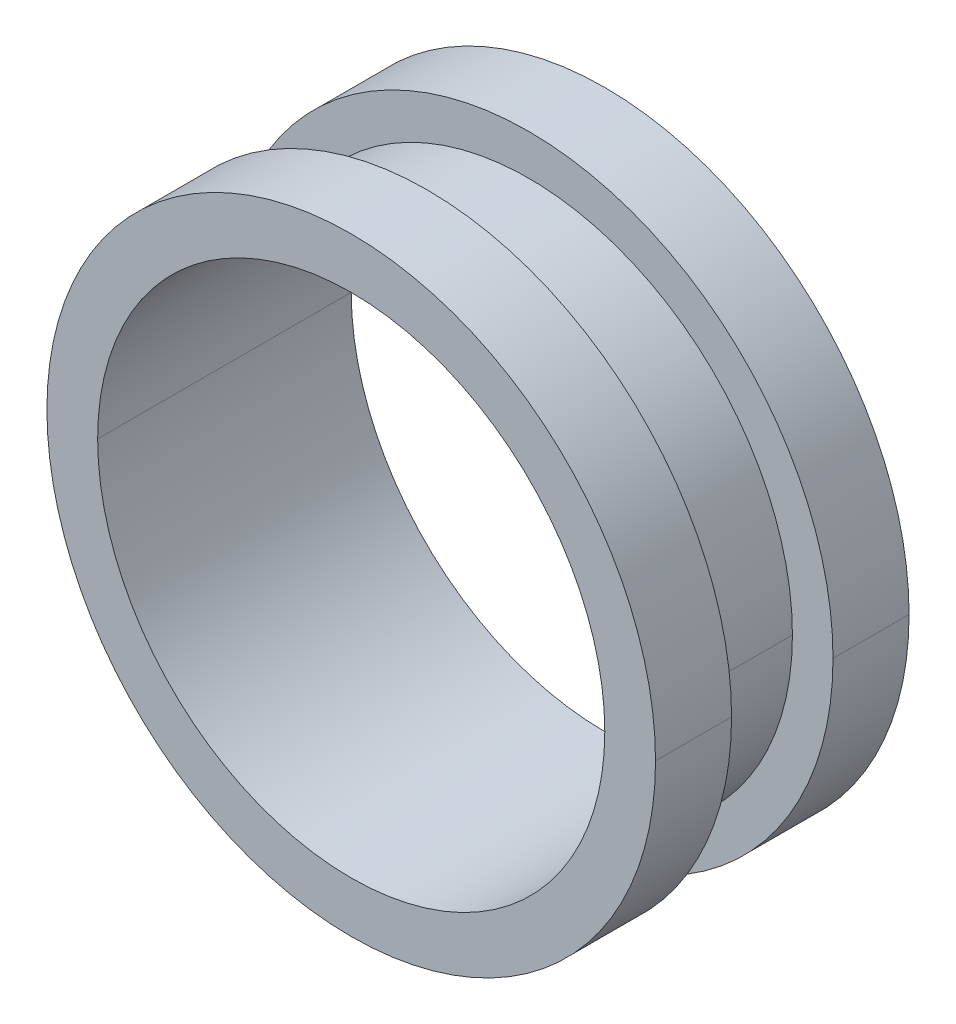
ISO-10303-21;
HEADER;
FILE_DESCRIPTION(('STEP AP214'),'2;1');
FILE_NAME('part.step','',(''),(''),'','','');
FILE_SCHEMA(('AUTOMOTIVE_DESIGN { 1 0 10303 214 1 1 1 1 }'));
ENDSEC;
DATA;
#1=APPLICATION_CONTEXT('core data for automotive mechanical design processes');
#2=APPLICATION_PROTOCOL_DEFINITION('international standard','automotive_design',2000,#1);
#3=PRODUCT_CONTEXT('',#1,'mechanical');
#4=PRODUCT('Part','Part','',(#3));
#5=PRODUCT_RELATED_PRODUCT_CATEGORY('part','',(#4));
#6=PRODUCT_DEFINITION_FORMATION('','',#4);
#7=PRODUCT_DEFINITION_CONTEXT('part definition',#1,'design');
#8=PRODUCT_DEFINITION('design','',#6,#7);
#9=PRODUCT_DEFINITION_SHAPE('','',#8);
#10=(LENGTH_UNIT() NAMED_UNIT(*) SI_UNIT(.MILLI.,.METRE.));
#11=(NAMED_UNIT(*) PLANE_ANGLE_UNIT() SI_UNIT($,.RADIAN.));
#12=(NAMED_UNIT(*) SI_UNIT($,.STERADIAN.) SOLID_ANGLE_UNIT());
#13=UNCERTAINTY_MEASURE_WITH_UNIT(LENGTH_MEASURE(1.E-05),#10,'distance_accuracy_value','');
#14=(GEOMETRIC_REPRESENTATION_CONTEXT(3) GLOBAL_UNCERTAINTY_ASSIGNED_CONTEXT((#13)) GLOBAL_UNIT_ASSIGNED_CONTEXT((#10,
#11,#12)) REPRESENTATION_CONTEXT('',''));
#15=CARTESIAN_POINT('',(0.,0.,0.));
#16=DIRECTION('',(0.,0.,1.));
#17=DIRECTION('',(1.,0.,0.));
#18=AXIS2_PLACEMENT_3D('',#15,#16,#17);
#19=CARTESIAN_POINT('',(0.,0.,-0.5));
#20=DIRECTION('',(0.,0.,1.));
#21=DIRECTION('',(1.,0.,0.));
#22=AXIS2_PLACEMENT_3D('',#19,#20,#21);
#23=CYLINDRICAL_SURFACE('',#22,2.6);
#24=DIRECTION('',(0.,0.,1.));
#25=VECTOR('',#24,1.);
#26=CARTESIAN_POINT('',(-2.6,0.,-0.5));
#27=LINE('',#26,#25);
#28=CARTESIAN_POINT('',(-2.6,0.,-0.5));
#29=VERTEX_POINT('',#28);
#30=CARTESIAN_POINT('',(-2.6,0.,0.5));
#31=VERTEX_POINT('',#30);
#32=EDGE_CURVE('E147',#29,#31,#27,.T.);
#33=ORIENTED_EDGE('',*,*,#32,.F.);
#34=CARTESIAN_POINT('',(0.,0.,-0.5));
#35=DIRECTION('',(0.,0.,1.));
#36=DIRECTION('',(1.,0.,0.));
#37=AXIS2_PLACEMENT_3D('',#34,#35,#36);
#38=CIRCLE('',#37,2.6);
#39=CARTESIAN_POINT('',(2.6,0.,-0.5));
#40=VERTEX_POINT('',#39);
#41=EDGE_CURVE('E27',#29,#40,#38,.T.);
#42=ORIENTED_EDGE('',*,*,#41,.T.);
#43=DIRECTION('',(0.,0.,1.));
#44=VECTOR('',#43,1.);
#45=CARTESIAN_POINT('',(2.6,0.,-0.5));
#46=LINE('',#45,#44);
#47=CARTESIAN_POINT('',(2.6,0.,0.5));
#48=VERTEX_POINT('',#47);
#49=EDGE_CURVE('E135',#40,#48,#46,.T.);
#50=ORIENTED_EDGE('',*,*,#49,.T.);
#51=CARTESIAN_POINT('',(0.,0.,0.5));
#52=DIRECTION('',(0.,0.,1.));
#53=DIRECTION('',(1.,0.,0.));
#54=AXIS2_PLACEMENT_3D('',#51,#52,#53);
#55=CIRCLE('',#54,2.6);
#56=EDGE_CURVE('E11',#31,#48,#55,.T.);
#57=ORIENTED_EDGE('',*,*,#56,.F.);
#58=EDGE_LOOP('',(#33,#42,#50,#57));
#59=FACE_BOUND('',#58,.T.);
#60=ADVANCED_FACE('F17',(#59),#23,.T.);
#61=CARTESIAN_POINT('',(0.,0.,0.5));
#62=DIRECTION('',(0.,0.,1.));
#63=DIRECTION('',(1.,0.,0.));
#64=AXIS2_PLACEMENT_3D('',#61,#62,#63);
#65=PLANE('',#64);
#66=CARTESIAN_POINT('',(0.,0.,0.5));
#67=DIRECTION('',(0.,0.,1.));
#68=DIRECTION('',(1.,0.,0.));
#69=AXIS2_PLACEMENT_3D('',#66,#67,#68);
#70=CIRCLE('',#69,2.6);
#71=EDGE_CURVE('E144',#48,#31,#70,.T.);
#72=ORIENTED_EDGE('',*,*,#71,.T.);
#73=ORIENTED_EDGE('',*,*,#56,.T.);
#74=EDGE_LOOP('',(#72,#73));
#75=FACE_BOUND('',#74,.T.);
#76=CARTESIAN_POINT('',(0.,0.,0.5));
#77=DIRECTION('',(0.,0.,1.));
#78=DIRECTION('',(1.,0.,0.));
#79=AXIS2_PLACEMENT_3D('',#76,#77,#78);
#80=CIRCLE('',#79,3.);
#81=CARTESIAN_POINT('',(-3.,0.,0.5));
#82=VERTEX_POINT('',#81);
#83=CARTESIAN_POINT('',(3.,0.,0.5));
#84=VERTEX_POINT('',#83);
#85=EDGE_CURVE('E118',#82,#84,#80,.T.);
#86=ORIENTED_EDGE('',*,*,#85,.F.);
#87=CARTESIAN_POINT('',(0.,0.,0.5));
#88=DIRECTION('',(0.,0.,1.));
#89=DIRECTION('',(1.,0.,0.));
#90=AXIS2_PLACEMENT_3D('',#87,#88,#89);
#91=CIRCLE('',#90,3.);
#92=EDGE_CURVE('E142',#84,#82,#91,.T.);
#93=ORIENTED_EDGE('',*,*,#92,.F.);
#94=EDGE_LOOP('',(#86,#93));
#95=FACE_BOUND('',#94,.T.);
#96=ADVANCED_FACE('F204',(#75,#95),#65,.F.);
#97=CARTESIAN_POINT('',(0.,0.,-0.5));
#98=DIRECTION('',(0.,0.,1.));
#99=DIRECTION('',(1.,0.,0.));
#100=AXIS2_PLACEMENT_3D('',#97,#98,#99);
#101=PLANE('',#100);
#102=CARTESIAN_POINT('',(0.,0.,-0.5));
#103=DIRECTION('',(0.,0.,1.));
#104=DIRECTION('',(1.,0.,0.));
#105=AXIS2_PLACEMENT_3D('',#102,#103,#104);
#106=CIRCLE('',#105,2.6);
#107=EDGE_CURVE('E157',#40,#29,#106,.T.);
#108=ORIENTED_EDGE('',*,*,#107,.F.);
#109=ORIENTED_EDGE('',*,*,#41,.F.);
#110=EDGE_LOOP('',(#108,#109));
#111=FACE_BOUND('',#110,.T.);
#112=CARTESIAN_POINT('',(0.,0.,-0.5));
#113=DIRECTION('',(0.,0.,1.));
#114=DIRECTION('',(1.,0.,0.));
#115=AXIS2_PLACEMENT_3D('',#112,#113,#114);
#116=CIRCLE('',#115,3.);
#117=CARTESIAN_POINT('',(-3.,0.,-0.5));
#118=VERTEX_POINT('',#117);
#119=CARTESIAN_POINT('',(3.,0.,-0.5));
#120=VERTEX_POINT('',#119);
#121=EDGE_CURVE('E152',#118,#120,#116,.T.);
#122=ORIENTED_EDGE('',*,*,#121,.T.);
#123=CARTESIAN_POINT('',(0.,0.,-0.5));
#124=DIRECTION('',(0.,0.,1.));
#125=DIRECTION('',(1.,0.,0.));
#126=AXIS2_PLACEMENT_3D('',#123,#124,#125);
#127=CIRCLE('',#126,3.);
#128=EDGE_CURVE('E172',#120,#118,#127,.T.);
#129=ORIENTED_EDGE('',*,*,#128,.T.);
#130=EDGE_LOOP('',(#122,#129));
#131=FACE_BOUND('',#130,.T.);
#132=ADVANCED_FACE('F296',(#111,#131),#101,.T.);
#133=CARTESIAN_POINT('',(0.,0.,1.25));
#134=DIRECTION('',(0.,0.,-1.));
#135=DIRECTION('',(-1.,0.,0.));
#136=AXIS2_PLACEMENT_3D('',#133,#134,#135);
#137=CYLINDRICAL_SURFACE('',#136,2.5);
#138=DIRECTION('',(0.,0.,-1.));
#139=VECTOR('',#138,1.);
#140=CARTESIAN_POINT('',(2.5,0.,1.25));
#141=LINE('',#140,#139);
#142=CARTESIAN_POINT('',(2.5,0.,1.25));
#143=VERTEX_POINT('',#142);
#144=CARTESIAN_POINT('',(2.5,0.,-1.25));
#145=VERTEX_POINT('',#144);
#146=EDGE_CURVE('E111',#143,#145,#141,.T.);
#147=ORIENTED_EDGE('',*,*,#146,.F.);
#148=CARTESIAN_POINT('',(0.,0.,1.25));
#149=DIRECTION('',(0.,0.,1.));
#150=DIRECTION('',(1.,0.,0.));
#151=AXIS2_PLACEMENT_3D('',#148,#149,#150);
#152=CIRCLE('',#151,2.5);
#153=CARTESIAN_POINT('',(-2.5,0.,1.25));
#154=VERTEX_POINT('',#153);
#155=EDGE_CURVE('E119',#143,#154,#152,.T.);
#156=ORIENTED_EDGE('',*,*,#155,.T.);
#157=DIRECTION('',(0.,0.,-1.));
#158=VECTOR('',#157,1.);
#159=CARTESIAN_POINT('',(-2.5,0.,1.25));
#160=LINE('',#159,#158);
#161=CARTESIAN_POINT('',(-2.5,0.,-1.25));
#162=VERTEX_POINT('',#161);
#163=EDGE_CURVE('E114',#154,#162,#160,.T.);
#164=ORIENTED_EDGE('',*,*,#163,.T.);
#165=CARTESIAN_POINT('',(0.,0.,-1.25));
#166=DIRECTION('',(0.,0.,1.));
#167=DIRECTION('',(1.,0.,0.));
#168=AXIS2_PLACEMENT_3D('',#165,#166,#167);
#169=CIRCLE('',#168,2.5);
#170=EDGE_CURVE('E107',#145,#162,#169,.T.);
#171=ORIENTED_EDGE('',*,*,#170,.F.);
#172=EDGE_LOOP('',(#147,#156,#164,#171));
#173=FACE_BOUND('',#172,.T.);
#174=ADVANCED_FACE('F109',(#173),#137,.F.);
#175=CARTESIAN_POINT('',(0.,0.,1.25));
#176=DIRECTION('',(0.,0.,-1.));
#177=DIRECTION('',(-1.,0.,0.));
#178=AXIS2_PLACEMENT_3D('',#175,#176,#177);
#179=CYLINDRICAL_SURFACE('',#178,3.);
#180=DIRECTION('',(0.,0.,-1.));
#181=VECTOR('',#180,1.);
#182=CARTESIAN_POINT('',(3.,0.,1.25));
#183=LINE('',#182,#181);
#184=CARTESIAN_POINT('',(3.,0.,1.25));
#185=VERTEX_POINT('',#184);
#186=EDGE_CURVE('E138',#185,#84,#183,.T.);
#187=ORIENTED_EDGE('',*,*,#186,.F.);
#188=CARTESIAN_POINT('',(0.,0.,1.25));
#189=DIRECTION('',(0.,0.,1.));
#190=DIRECTION('',(1.,0.,0.));
#191=AXIS2_PLACEMENT_3D('',#188,#189,#190);
#192=CIRCLE('',#191,3.);
#193=CARTESIAN_POINT('',(-3.,0.,1.25));
#194=VERTEX_POINT('',#193);
#195=EDGE_CURVE('E21',#194,#185,#192,.T.);
#196=ORIENTED_EDGE('',*,*,#195,.F.);
#197=DIRECTION('',(0.,0.,-1.));
#198=VECTOR('',#197,1.);
#199=CARTESIAN_POINT('',(-3.,0.,1.25));
#200=LINE('',#199,#198);
#201=EDGE_CURVE('E176',#194,#82,#200,.T.);
#202=ORIENTED_EDGE('',*,*,#201,.T.);
#203=ORIENTED_EDGE('',*,*,#85,.T.);
#204=EDGE_LOOP('',(#187,#196,#202,#203));
#205=FACE_BOUND('',#204,.T.);
#206=ADVANCED_FACE('F206',(#205),#179,.T.);
#207=CARTESIAN_POINT('',(0.,0.,-1.25));
#208=DIRECTION('',(0.,0.,1.));
#209=DIRECTION('',(1.,0.,0.));
#210=AXIS2_PLACEMENT_3D('',#207,#208,#209);
#211=PLANE('',#210);
#212=CARTESIAN_POINT('',(0.,0.,-1.25));
#213=DIRECTION('',(0.,0.,1.));
#214=DIRECTION('',(1.,0.,0.));
#215=AXIS2_PLACEMENT_3D('',#212,#213,#214);
#216=CIRCLE('',#215,2.5);
#217=EDGE_CURVE('E121',#162,#145,#216,.T.);
#218=ORIENTED_EDGE('',*,*,#217,.T.);
#219=ORIENTED_EDGE('',*,*,#170,.T.);
#220=EDGE_LOOP('',(#218,#219));
#221=FACE_BOUND('',#220,.T.);
#222=CARTESIAN_POINT('',(0.,0.,-1.25));
#223=DIRECTION('',(0.,0.,1.));
#224=DIRECTION('',(1.,0.,0.));
#225=AXIS2_PLACEMENT_3D('',#222,#223,#224);
#226=CIRCLE('',#225,3.);
#227=CARTESIAN_POINT('',(-3.,0.,-1.25));
#228=VERTEX_POINT('',#227);
#229=CARTESIAN_POINT('',(3.,0.,-1.25));
#230=VERTEX_POINT('',#229);
#231=EDGE_CURVE('E40',#228,#230,#226,.T.);
#232=ORIENTED_EDGE('',*,*,#231,.F.);
#233=CARTESIAN_POINT('',(0.,0.,-1.25));
#234=DIRECTION('',(0.,0.,1.));
#235=DIRECTION('',(1.,0.,0.));
#236=AXIS2_PLACEMENT_3D('',#233,#234,#235);
#237=CIRCLE('',#236,3.);
#238=EDGE_CURVE('E153',#230,#228,#237,.T.);
#239=ORIENTED_EDGE('',*,*,#238,.F.);
#240=EDGE_LOOP('',(#232,#239));
#241=FACE_BOUND('',#240,.T.);
#242=ADVANCED_FACE('F122',(#221,#241),#211,.F.);
#243=CARTESIAN_POINT('',(0.,0.,1.25));
#244=DIRECTION('',(0.,0.,1.));
#245=DIRECTION('',(1.,0.,0.));
#246=AXIS2_PLACEMENT_3D('',#243,#244,#245);
#247=PLANE('',#246);
#248=CARTESIAN_POINT('',(0.,0.,1.25));
#249=DIRECTION('',(0.,0.,1.));
#250=DIRECTION('',(1.,0.,0.));
#251=AXIS2_PLACEMENT_3D('',#248,#249,#250);
#252=CIRCLE('',#251,2.5);
#253=EDGE_CURVE('E128',#154,#143,#252,.T.);
#254=ORIENTED_EDGE('',*,*,#253,.F.);
#255=ORIENTED_EDGE('',*,*,#155,.F.);
#256=EDGE_LOOP('',(#254,#255));
#257=FACE_BOUND('',#256,.T.);
#258=ORIENTED_EDGE('',*,*,#195,.T.);
#259=CARTESIAN_POINT('',(0.,0.,1.25));
#260=DIRECTION('',(0.,0.,1.));
#261=DIRECTION('',(1.,0.,0.));
#262=AXIS2_PLACEMENT_3D('',#259,#260,#261);
#263=CIRCLE('',#262,3.);
#264=EDGE_CURVE('E143',#185,#194,#263,.T.);
#265=ORIENTED_EDGE('',*,*,#264,.T.);
#266=EDGE_LOOP('',(#258,#265));
#267=FACE_BOUND('',#266,.T.);
#268=ADVANCED_FACE('F284',(#257,#267),#247,.T.);
#269=CARTESIAN_POINT('',(0.,0.,1.25));
#270=DIRECTION('',(0.,0.,-1.));
#271=DIRECTION('',(-1.,0.,0.));
#272=AXIS2_PLACEMENT_3D('',#269,#270,#271);
#273=CYLINDRICAL_SURFACE('',#272,3.);
#274=DIRECTION('',(0.,0.,-1.));
#275=VECTOR('',#274,1.);
#276=CARTESIAN_POINT('',(3.,0.,1.25));
#277=LINE('',#276,#275);
#278=EDGE_CURVE('E168',#120,#230,#277,.T.);
#279=ORIENTED_EDGE('',*,*,#278,.F.);
#280=ORIENTED_EDGE('',*,*,#121,.F.);
#281=DIRECTION('',(0.,0.,-1.));
#282=VECTOR('',#281,1.);
#283=CARTESIAN_POINT('',(-3.,0.,1.25));
#284=LINE('',#283,#282);
#285=EDGE_CURVE('E149',#118,#228,#284,.T.);
#286=ORIENTED_EDGE('',*,*,#285,.T.);
#287=ORIENTED_EDGE('',*,*,#231,.T.);
#288=EDGE_LOOP('',(#279,#280,#286,#287));
#289=FACE_BOUND('',#288,.T.);
#290=ADVANCED_FACE('F19',(#289),#273,.T.);
#291=CARTESIAN_POINT('',(0.,0.,1.25));
#292=DIRECTION('',(0.,0.,-1.));
#293=DIRECTION('',(-1.,0.,0.));
#294=AXIS2_PLACEMENT_3D('',#291,#292,#293);
#295=CYLINDRICAL_SURFACE('',#294,3.);
#296=ORIENTED_EDGE('',*,*,#128,.F.);
#297=ORIENTED_EDGE('',*,*,#278,.T.);
#298=ORIENTED_EDGE('',*,*,#238,.T.);
#299=ORIENTED_EDGE('',*,*,#285,.F.);
#300=EDGE_LOOP('',(#296,#297,#298,#299));
#301=FACE_BOUND('',#300,.T.);
#302=ADVANCED_FACE('F271',(#301),#295,.T.);
#303=CARTESIAN_POINT('',(0.,0.,1.25));
#304=DIRECTION('',(0.,0.,-1.));
#305=DIRECTION('',(-1.,0.,0.));
#306=AXIS2_PLACEMENT_3D('',#303,#304,#305);
#307=CYLINDRICAL_SURFACE('',#306,3.);
#308=ORIENTED_EDGE('',*,*,#264,.F.);
#309=ORIENTED_EDGE('',*,*,#186,.T.);
#310=ORIENTED_EDGE('',*,*,#92,.T.);
#311=ORIENTED_EDGE('',*,*,#201,.F.);
#312=EDGE_LOOP('',(#308,#309,#310,#311));
#313=FACE_BOUND('',#312,.T.);
#314=ADVANCED_FACE('F201',(#313),#307,.T.);
#315=CARTESIAN_POINT('',(0.,0.,1.25));
#316=DIRECTION('',(0.,0.,-1.));
#317=DIRECTION('',(-1.,0.,0.));
#318=AXIS2_PLACEMENT_3D('',#315,#316,#317);
#319=CYLINDRICAL_SURFACE('',#318,2.5);
#320=ORIENTED_EDGE('',*,*,#253,.T.);
#321=ORIENTED_EDGE('',*,*,#146,.T.);
#322=ORIENTED_EDGE('',*,*,#217,.F.);
#323=ORIENTED_EDGE('',*,*,#163,.F.);
#324=EDGE_LOOP('',(#320,#321,#322,#323));
#325=FACE_BOUND('',#324,.T.);
#326=ADVANCED_FACE('F126',(#325),#319,.F.);
#327=CARTESIAN_POINT('',(0.,0.,-0.5));
#328=DIRECTION('',(0.,0.,1.));
#329=DIRECTION('',(1.,0.,0.));
#330=AXIS2_PLACEMENT_3D('',#327,#328,#329);
#331=CYLINDRICAL_SURFACE('',#330,2.6);
#332=ORIENTED_EDGE('',*,*,#107,.T.);
#333=ORIENTED_EDGE('',*,*,#32,.T.);
#334=ORIENTED_EDGE('',*,*,#71,.F.);
#335=ORIENTED_EDGE('',*,*,#49,.F.);
#336=EDGE_LOOP('',(#332,#333,#334,#335));
#337=FACE_BOUND('',#336,.T.);
#338=ADVANCED_FACE('F342',(#337),#331,.T.);
#339=CLOSED_SHELL('',(#60,#96,#132,#174,#206,#242,#268,#290,#302,#314,#326,#338));
#340=MANIFOLD_SOLID_BREP('B1',#339);
#341=ADVANCED_BREP_SHAPE_REPRESENTATION('',(#18,#340),#14);
#342=SHAPE_DEFINITION_REPRESENTATION(#9,#341);
ENDSEC;
END-ISO-10303-21;
